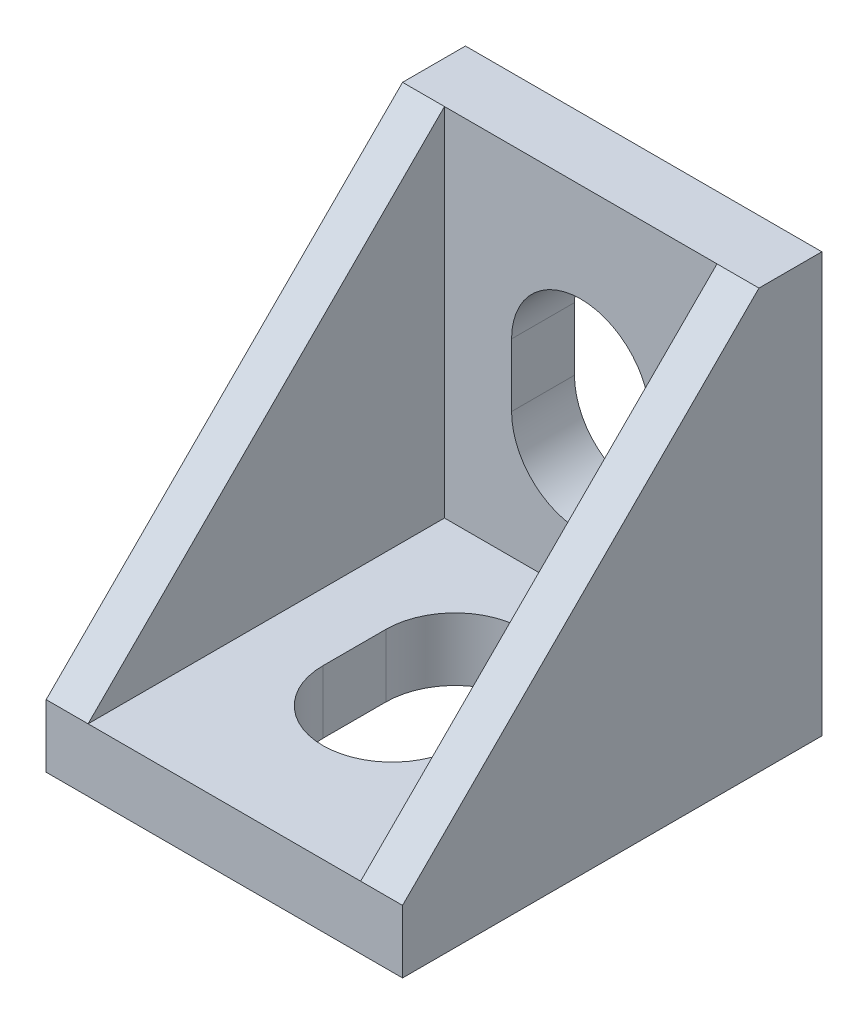
ISO-10303-21;
HEADER;
FILE_DESCRIPTION(('STEP AP214'),'2;1');
FILE_NAME('part.step','',(''),(''),'','','');
FILE_SCHEMA(('AUTOMOTIVE_DESIGN { 1 0 10303 214 1 1 1 1 }'));
ENDSEC;
DATA;
#1=APPLICATION_CONTEXT('core data for automotive mechanical design processes');
#2=APPLICATION_PROTOCOL_DEFINITION('international standard','automotive_design',2000,#1);
#3=PRODUCT_CONTEXT('',#1,'mechanical');
#4=PRODUCT('Part','Part','',(#3));
#5=PRODUCT_RELATED_PRODUCT_CATEGORY('part','',(#4));
#6=PRODUCT_DEFINITION_FORMATION('','',#4);
#7=PRODUCT_DEFINITION_CONTEXT('part definition',#1,'design');
#8=PRODUCT_DEFINITION('design','',#6,#7);
#9=PRODUCT_DEFINITION_SHAPE('','',#8);
#10=(LENGTH_UNIT() NAMED_UNIT(*) SI_UNIT(.MILLI.,.METRE.));
#11=(NAMED_UNIT(*) PLANE_ANGLE_UNIT() SI_UNIT($,.RADIAN.));
#12=(NAMED_UNIT(*) SI_UNIT($,.STERADIAN.) SOLID_ANGLE_UNIT());
#13=UNCERTAINTY_MEASURE_WITH_UNIT(LENGTH_MEASURE(1.E-05),#10,'distance_accuracy_value','');
#14=(GEOMETRIC_REPRESENTATION_CONTEXT(3) GLOBAL_UNCERTAINTY_ASSIGNED_CONTEXT((#13)) GLOBAL_UNIT_ASSIGNED_CONTEXT((#10,
#11,#12)) REPRESENTATION_CONTEXT('',''));
#15=CARTESIAN_POINT('',(0.,0.,0.));
#16=DIRECTION('',(0.,0.,1.));
#17=DIRECTION('',(1.,0.,0.));
#18=AXIS2_PLACEMENT_3D('',#15,#16,#17);
#19=CARTESIAN_POINT('',(8.5,0.,0.));
#20=DIRECTION('',(0.,1.,0.));
#21=DIRECTION('',(0.,0.,1.));
#22=AXIS2_PLACEMENT_3D('',#19,#20,#21);
#23=PLANE('',#22);
#24=DIRECTION('',(0.,0.,-1.));
#25=VECTOR('',#24,1.);
#26=CARTESIAN_POINT('',(-2.24999999999999,0.,18.6));
#27=LINE('',#26,#25);
#28=CARTESIAN_POINT('',(-2.24999999999999,0.,18.6));
#29=VERTEX_POINT('',#28);
#30=CARTESIAN_POINT('',(-2.24999999999999,0.,17.));
#31=VERTEX_POINT('',#30);
#32=EDGE_CURVE('E267',#29,#31,#27,.T.);
#33=ORIENTED_EDGE('',*,*,#32,.F.);
#34=DIRECTION('',(-1.,0.,0.));
#35=VECTOR('',#34,1.);
#36=CARTESIAN_POINT('',(-2.24999999999999,0.,18.6));
#37=LINE('',#36,#35);
#38=CARTESIAN_POINT('',(2.25000000000001,0.,18.6));
#39=VERTEX_POINT('',#38);
#40=EDGE_CURVE('E280',#39,#29,#37,.T.);
#41=ORIENTED_EDGE('',*,*,#40,.F.);
#42=DIRECTION('',(0.,0.,1.));
#43=VECTOR('',#42,1.);
#44=CARTESIAN_POINT('',(2.25000000000001,0.,18.6));
#45=LINE('',#44,#43);
#46=CARTESIAN_POINT('',(2.24999999999999,0.,17.));
#47=VERTEX_POINT('',#46);
#48=EDGE_CURVE('E289',#47,#39,#45,.T.);
#49=ORIENTED_EDGE('',*,*,#48,.F.);
#50=DIRECTION('',(1.,0.,0.));
#51=VECTOR('',#50,1.);
#52=CARTESIAN_POINT('',(-2.24999999999999,0.,17.));
#53=LINE('',#52,#51);
#54=EDGE_CURVE('E270',#31,#47,#53,.T.);
#55=ORIENTED_EDGE('',*,*,#54,.F.);
#56=EDGE_LOOP('',(#33,#41,#49,#55));
#57=FACE_BOUND('',#56,.T.);
#58=DIRECTION('',(0.,0.,-1.));
#59=VECTOR('',#58,1.);
#60=CARTESIAN_POINT('',(3.3,0.,9.));
#61=LINE('',#60,#59);
#62=CARTESIAN_POINT('',(3.3,0.,12.));
#63=VERTEX_POINT('',#62);
#64=CARTESIAN_POINT('',(3.3,0.,9.));
#65=VERTEX_POINT('',#64);
#66=EDGE_CURVE('E382',#63,#65,#61,.T.);
#67=ORIENTED_EDGE('',*,*,#66,.T.);
#68=CARTESIAN_POINT('',(0.,0.,9.));
#69=DIRECTION('',(0.,1.,0.));
#70=DIRECTION('',(0.,0.,1.));
#71=AXIS2_PLACEMENT_3D('',#68,#69,#70);
#72=CIRCLE('',#71,3.3);
#73=CARTESIAN_POINT('',(-3.3,0.,9.));
#74=VERTEX_POINT('',#73);
#75=EDGE_CURVE('E372',#65,#74,#72,.T.);
#76=ORIENTED_EDGE('',*,*,#75,.T.);
#77=DIRECTION('',(0.,0.,1.));
#78=VECTOR('',#77,1.);
#79=CARTESIAN_POINT('',(-3.3,0.,9.));
#80=LINE('',#79,#78);
#81=CARTESIAN_POINT('',(-3.3,0.,12.));
#82=VERTEX_POINT('',#81);
#83=EDGE_CURVE('E375',#74,#82,#80,.T.);
#84=ORIENTED_EDGE('',*,*,#83,.T.);
#85=CARTESIAN_POINT('',(0.,0.,12.));
#86=DIRECTION('',(0.,1.,0.));
#87=DIRECTION('',(0.,0.,1.));
#88=AXIS2_PLACEMENT_3D('',#85,#86,#87);
#89=CIRCLE('',#88,3.3);
#90=EDGE_CURVE('E379',#82,#63,#89,.T.);
#91=ORIENTED_EDGE('',*,*,#90,.T.);
#92=EDGE_LOOP('',(#67,#76,#84,#91));
#93=FACE_BOUND('',#92,.T.);
#94=DIRECTION('',(0.,0.,-1.));
#95=VECTOR('',#94,1.);
#96=CARTESIAN_POINT('',(-8.5,0.,0.));
#97=LINE('',#96,#95);
#98=CARTESIAN_POINT('',(-8.5,0.,20.));
#99=VERTEX_POINT('',#98);
#100=CARTESIAN_POINT('',(-8.5,0.,0.));
#101=VERTEX_POINT('',#100);
#102=EDGE_CURVE('E471',#99,#101,#97,.T.);
#103=ORIENTED_EDGE('',*,*,#102,.T.);
#104=DIRECTION('',(-1.,0.,0.));
#105=VECTOR('',#104,1.);
#106=CARTESIAN_POINT('',(8.5,0.,0.));
#107=LINE('',#106,#105);
#108=CARTESIAN_POINT('',(8.5,0.,0.));
#109=VERTEX_POINT('',#108);
#110=EDGE_CURVE('E478',#109,#101,#107,.T.);
#111=ORIENTED_EDGE('',*,*,#110,.F.);
#112=DIRECTION('',(0.,0.,-1.));
#113=VECTOR('',#112,1.);
#114=CARTESIAN_POINT('',(8.5,0.,0.));
#115=LINE('',#114,#113);
#116=CARTESIAN_POINT('',(8.5,0.,20.));
#117=VERTEX_POINT('',#116);
#118=EDGE_CURVE('E476',#117,#109,#115,.T.);
#119=ORIENTED_EDGE('',*,*,#118,.F.);
#120=DIRECTION('',(-1.,0.,0.));
#121=VECTOR('',#120,1.);
#122=CARTESIAN_POINT('',(8.5,0.,20.));
#123=LINE('',#122,#121);
#124=EDGE_CURVE('E489',#117,#99,#123,.T.);
#125=ORIENTED_EDGE('',*,*,#124,.T.);
#126=EDGE_LOOP('',(#103,#111,#119,#125));
#127=FACE_BOUND('',#126,.T.);
#128=DIRECTION('',(0.,0.,-1.));
#129=VECTOR('',#128,1.);
#130=CARTESIAN_POINT('',(-2.25,0.,3.));
#131=LINE('',#130,#129);
#132=CARTESIAN_POINT('',(-2.25,0.,3.));
#133=VERTEX_POINT('',#132);
#134=CARTESIAN_POINT('',(-2.25,0.,1.4));
#135=VERTEX_POINT('',#134);
#136=EDGE_CURVE('E266',#133,#135,#131,.T.);
#137=ORIENTED_EDGE('',*,*,#136,.F.);
#138=DIRECTION('',(-1.,0.,0.));
#139=VECTOR('',#138,1.);
#140=CARTESIAN_POINT('',(-2.25,0.,3.));
#141=LINE('',#140,#139);
#142=CARTESIAN_POINT('',(2.25,0.,3.));
#143=VERTEX_POINT('',#142);
#144=EDGE_CURVE('E263',#143,#133,#141,.T.);
#145=ORIENTED_EDGE('',*,*,#144,.F.);
#146=DIRECTION('',(0.,0.,1.));
#147=VECTOR('',#146,1.);
#148=CARTESIAN_POINT('',(2.25,0.,3.));
#149=LINE('',#148,#147);
#150=CARTESIAN_POINT('',(2.25,0.,1.4));
#151=VERTEX_POINT('',#150);
#152=EDGE_CURVE('E57',#151,#143,#149,.T.);
#153=ORIENTED_EDGE('',*,*,#152,.F.);
#154=DIRECTION('',(1.,0.,0.));
#155=VECTOR('',#154,1.);
#156=CARTESIAN_POINT('',(-2.25,0.,1.4));
#157=LINE('',#156,#155);
#158=EDGE_CURVE('E52',#135,#151,#157,.T.);
#159=ORIENTED_EDGE('',*,*,#158,.F.);
#160=EDGE_LOOP('',(#137,#145,#153,#159));
#161=FACE_BOUND('',#160,.T.);
#162=ADVANCED_FACE('F37',(#57,#93,#127,#161),#23,.F.);
#163=CARTESIAN_POINT('',(8.5,0.,0.));
#164=DIRECTION('',(0.,0.,1.));
#165=DIRECTION('',(1.,0.,0.));
#166=AXIS2_PLACEMENT_3D('',#163,#164,#165);
#167=PLANE('',#166);
#168=DIRECTION('',(0.,-1.,0.));
#169=VECTOR('',#168,1.);
#170=CARTESIAN_POINT('',(2.25000000000001,18.6,0.));
#171=LINE('',#170,#169);
#172=CARTESIAN_POINT('',(2.25000000000001,18.6,0.));
#173=VERTEX_POINT('',#172);
#174=CARTESIAN_POINT('',(2.25000000000001,17.,0.));
#175=VERTEX_POINT('',#174);
#176=EDGE_CURVE('E338',#173,#175,#171,.T.);
#177=ORIENTED_EDGE('',*,*,#176,.F.);
#178=DIRECTION('',(1.,0.,0.));
#179=VECTOR('',#178,1.);
#180=CARTESIAN_POINT('',(2.25000000000001,18.6,0.));
#181=LINE('',#180,#179);
#182=CARTESIAN_POINT('',(-2.24999999999999,18.6,0.));
#183=VERTEX_POINT('',#182);
#184=EDGE_CURVE('E343',#183,#173,#181,.T.);
#185=ORIENTED_EDGE('',*,*,#184,.F.);
#186=DIRECTION('',(0.,1.,0.));
#187=VECTOR('',#186,1.);
#188=CARTESIAN_POINT('',(-2.24999999999999,18.6,0.));
#189=LINE('',#188,#187);
#190=CARTESIAN_POINT('',(-2.25000000000001,17.,0.));
#191=VERTEX_POINT('',#190);
#192=EDGE_CURVE('E355',#191,#183,#189,.T.);
#193=ORIENTED_EDGE('',*,*,#192,.F.);
#194=DIRECTION('',(-1.,0.,0.));
#195=VECTOR('',#194,1.);
#196=CARTESIAN_POINT('',(2.25000000000001,17.,0.));
#197=LINE('',#196,#195);
#198=EDGE_CURVE('E352',#175,#191,#197,.T.);
#199=ORIENTED_EDGE('',*,*,#198,.F.);
#200=EDGE_LOOP('',(#177,#185,#193,#199));
#201=FACE_BOUND('',#200,.T.);
#202=DIRECTION('',(0.,-1.,0.));
#203=VECTOR('',#202,1.);
#204=CARTESIAN_POINT('',(-3.3,9.,0.));
#205=LINE('',#204,#203);
#206=CARTESIAN_POINT('',(-3.3,12.,0.));
#207=VERTEX_POINT('',#206);
#208=CARTESIAN_POINT('',(-3.3,9.,0.));
#209=VERTEX_POINT('',#208);
#210=EDGE_CURVE('E414',#207,#209,#205,.T.);
#211=ORIENTED_EDGE('',*,*,#210,.T.);
#212=CARTESIAN_POINT('',(0.,9.,0.));
#213=DIRECTION('',(0.,0.,1.));
#214=DIRECTION('',(1.,0.,0.));
#215=AXIS2_PLACEMENT_3D('',#212,#213,#214);
#216=CIRCLE('',#215,3.3);
#217=CARTESIAN_POINT('',(3.3,9.,0.));
#218=VERTEX_POINT('',#217);
#219=EDGE_CURVE('E404',#209,#218,#216,.T.);
#220=ORIENTED_EDGE('',*,*,#219,.T.);
#221=DIRECTION('',(0.,1.,0.));
#222=VECTOR('',#221,1.);
#223=CARTESIAN_POINT('',(3.3,9.,0.));
#224=LINE('',#223,#222);
#225=CARTESIAN_POINT('',(3.3,12.,0.));
#226=VERTEX_POINT('',#225);
#227=EDGE_CURVE('E407',#218,#226,#224,.T.);
#228=ORIENTED_EDGE('',*,*,#227,.T.);
#229=CARTESIAN_POINT('',(0.,12.,0.));
#230=DIRECTION('',(0.,0.,1.));
#231=DIRECTION('',(1.,0.,0.));
#232=AXIS2_PLACEMENT_3D('',#229,#230,#231);
#233=CIRCLE('',#232,3.3);
#234=EDGE_CURVE('E411',#226,#207,#233,.T.);
#235=ORIENTED_EDGE('',*,*,#234,.T.);
#236=EDGE_LOOP('',(#211,#220,#228,#235));
#237=FACE_BOUND('',#236,.T.);
#238=DIRECTION('',(0.,1.,0.));
#239=VECTOR('',#238,1.);
#240=CARTESIAN_POINT('',(-8.5,0.,0.));
#241=LINE('',#240,#239);
#242=CARTESIAN_POINT('',(-8.5,20.,0.));
#243=VERTEX_POINT('',#242);
#244=EDGE_CURVE('E462',#101,#243,#241,.T.);
#245=ORIENTED_EDGE('',*,*,#244,.T.);
#246=DIRECTION('',(-1.,0.,0.));
#247=VECTOR('',#246,1.);
#248=CARTESIAN_POINT('',(8.5,20.,0.));
#249=LINE('',#248,#247);
#250=CARTESIAN_POINT('',(8.5,20.,0.));
#251=VERTEX_POINT('',#250);
#252=EDGE_CURVE('E492',#251,#243,#249,.T.);
#253=ORIENTED_EDGE('',*,*,#252,.F.);
#254=DIRECTION('',(0.,1.,0.));
#255=VECTOR('',#254,1.);
#256=CARTESIAN_POINT('',(8.5,0.,0.));
#257=LINE('',#256,#255);
#258=EDGE_CURVE('E467',#109,#251,#257,.T.);
#259=ORIENTED_EDGE('',*,*,#258,.F.);
#260=ORIENTED_EDGE('',*,*,#110,.T.);
#261=EDGE_LOOP('',(#245,#253,#259,#260));
#262=FACE_BOUND('',#261,.T.);
#263=DIRECTION('',(0.,-1.,0.));
#264=VECTOR('',#263,1.);
#265=CARTESIAN_POINT('',(2.25000000000001,3.,0.));
#266=LINE('',#265,#264);
#267=CARTESIAN_POINT('',(2.25000000000001,3.,0.));
#268=VERTEX_POINT('',#267);
#269=CARTESIAN_POINT('',(2.25000000000001,1.4,0.));
#270=VERTEX_POINT('',#269);
#271=EDGE_CURVE('E305',#268,#270,#266,.T.);
#272=ORIENTED_EDGE('',*,*,#271,.F.);
#273=DIRECTION('',(1.,0.,0.));
#274=VECTOR('',#273,1.);
#275=CARTESIAN_POINT('',(2.25000000000001,3.,0.));
#276=LINE('',#275,#274);
#277=CARTESIAN_POINT('',(-2.25000000000001,3.,0.));
#278=VERTEX_POINT('',#277);
#279=EDGE_CURVE('E310',#278,#268,#276,.T.);
#280=ORIENTED_EDGE('',*,*,#279,.F.);
#281=DIRECTION('',(0.,1.,0.));
#282=VECTOR('',#281,1.);
#283=CARTESIAN_POINT('',(-2.25000000000001,3.,0.));
#284=LINE('',#283,#282);
#285=CARTESIAN_POINT('',(-2.25000000000001,1.4,0.));
#286=VERTEX_POINT('',#285);
#287=EDGE_CURVE('E322',#286,#278,#284,.T.);
#288=ORIENTED_EDGE('',*,*,#287,.F.);
#289=DIRECTION('',(-1.,0.,0.));
#290=VECTOR('',#289,1.);
#291=CARTESIAN_POINT('',(2.25000000000001,1.4,0.));
#292=LINE('',#291,#290);
#293=EDGE_CURVE('E319',#270,#286,#292,.T.);
#294=ORIENTED_EDGE('',*,*,#293,.F.);
#295=EDGE_LOOP('',(#272,#280,#288,#294));
#296=FACE_BOUND('',#295,.T.);
#297=ADVANCED_FACE('F39',(#201,#237,#262,#296),#167,.F.);
#298=CARTESIAN_POINT('',(8.5,20.,3.));
#299=DIRECTION('',(0.,-0.707106781186547,-0.707106781186548));
#300=DIRECTION('',(0.,0.707106781186548,-0.707106781186547));
#301=AXIS2_PLACEMENT_3D('',#298,#299,#300);
#302=PLANE('',#301);
#303=DIRECTION('',(-1.,0.,0.));
#304=VECTOR('',#303,1.);
#305=CARTESIAN_POINT('',(8.5,3.,20.));
#306=LINE('',#305,#304);
#307=CARTESIAN_POINT('',(-6.5,3.,20.));
#308=VERTEX_POINT('',#307);
#309=CARTESIAN_POINT('',(-8.5,3.,20.));
#310=VERTEX_POINT('',#309);
#311=EDGE_CURVE('E463',#308,#310,#306,.T.);
#312=ORIENTED_EDGE('',*,*,#311,.F.);
#313=DIRECTION('',(0.,0.707106781186548,-0.707106781186547));
#314=VECTOR('',#313,1.);
#315=CARTESIAN_POINT('',(-6.5,20.,3.));
#316=LINE('',#315,#314);
#317=CARTESIAN_POINT('',(-6.5,20.,3.00000000000001));
#318=VERTEX_POINT('',#317);
#319=EDGE_CURVE('E13',#308,#318,#316,.T.);
#320=ORIENTED_EDGE('',*,*,#319,.T.);
#321=DIRECTION('',(-1.,0.,0.));
#322=VECTOR('',#321,1.);
#323=CARTESIAN_POINT('',(8.5,20.,3.));
#324=LINE('',#323,#322);
#325=CARTESIAN_POINT('',(-8.5,20.,3.));
#326=VERTEX_POINT('',#325);
#327=EDGE_CURVE('E456',#318,#326,#324,.T.);
#328=ORIENTED_EDGE('',*,*,#327,.T.);
#329=DIRECTION('',(0.,-0.707106781186548,0.707106781186547));
#330=VECTOR('',#329,1.);
#331=CARTESIAN_POINT('',(-8.5,20.,3.));
#332=LINE('',#331,#330);
#333=EDGE_CURVE('E452',#326,#310,#332,.T.);
#334=ORIENTED_EDGE('',*,*,#333,.T.);
#335=EDGE_LOOP('',(#312,#320,#328,#334));
#336=FACE_BOUND('',#335,.T.);
#337=ADVANCED_FACE('F519',(#336),#302,.F.);
#338=CARTESIAN_POINT('',(8.5,20.,0.));
#339=DIRECTION('',(0.,-1.,0.));
#340=DIRECTION('',(0.,0.,-1.));
#341=AXIS2_PLACEMENT_3D('',#338,#339,#340);
#342=PLANE('',#341);
#343=DIRECTION('',(0.,0.,1.));
#344=VECTOR('',#343,1.);
#345=CARTESIAN_POINT('',(-8.5,20.,0.));
#346=LINE('',#345,#344);
#347=EDGE_CURVE('E481',#243,#326,#346,.T.);
#348=ORIENTED_EDGE('',*,*,#347,.T.);
#349=ORIENTED_EDGE('',*,*,#327,.F.);
#350=DIRECTION('',(-1.,0.,0.));
#351=VECTOR('',#350,1.);
#352=CARTESIAN_POINT('',(-6.5,20.,3.00000000000001));
#353=LINE('',#352,#351);
#354=CARTESIAN_POINT('',(6.5,20.,3.));
#355=VERTEX_POINT('',#354);
#356=EDGE_CURVE('E429',#355,#318,#353,.T.);
#357=ORIENTED_EDGE('',*,*,#356,.F.);
#358=CARTESIAN_POINT('',(8.5,20.,3.));
#359=VERTEX_POINT('',#358);
#360=EDGE_CURVE('E464',#359,#355,#324,.T.);
#361=ORIENTED_EDGE('',*,*,#360,.F.);
#362=DIRECTION('',(0.,0.,1.));
#363=VECTOR('',#362,1.);
#364=CARTESIAN_POINT('',(8.5,20.,0.));
#365=LINE('',#364,#363);
#366=EDGE_CURVE('E470',#251,#359,#365,.T.);
#367=ORIENTED_EDGE('',*,*,#366,.F.);
#368=ORIENTED_EDGE('',*,*,#252,.T.);
#369=EDGE_LOOP('',(#348,#349,#357,#361,#367,#368));
#370=FACE_BOUND('',#369,.T.);
#371=ADVANCED_FACE('F511',(#370),#342,.F.);
#372=CARTESIAN_POINT('',(8.5,0.,20.));
#373=DIRECTION('',(0.,0.,-1.));
#374=DIRECTION('',(-1.,0.,0.));
#375=AXIS2_PLACEMENT_3D('',#372,#373,#374);
#376=PLANE('',#375);
#377=DIRECTION('',(0.,-1.,0.));
#378=VECTOR('',#377,1.);
#379=CARTESIAN_POINT('',(8.5,0.,20.));
#380=LINE('',#379,#378);
#381=CARTESIAN_POINT('',(8.5,3.,20.));
#382=VERTEX_POINT('',#381);
#383=EDGE_CURVE('E474',#382,#117,#380,.T.);
#384=ORIENTED_EDGE('',*,*,#383,.F.);
#385=CARTESIAN_POINT('',(6.50000000000001,2.99999999999999,20.));
#386=VERTEX_POINT('',#385);
#387=EDGE_CURVE('E459',#382,#386,#306,.T.);
#388=ORIENTED_EDGE('',*,*,#387,.T.);
#389=DIRECTION('',(-1.,0.,0.));
#390=VECTOR('',#389,1.);
#391=CARTESIAN_POINT('',(-6.5,3.,20.));
#392=LINE('',#391,#390);
#393=EDGE_CURVE('E443',#386,#308,#392,.T.);
#394=ORIENTED_EDGE('',*,*,#393,.T.);
#395=ORIENTED_EDGE('',*,*,#311,.T.);
#396=DIRECTION('',(0.,-1.,0.));
#397=VECTOR('',#396,1.);
#398=CARTESIAN_POINT('',(-8.5,0.,20.));
#399=LINE('',#398,#397);
#400=EDGE_CURVE('E484',#310,#99,#399,.T.);
#401=ORIENTED_EDGE('',*,*,#400,.T.);
#402=ORIENTED_EDGE('',*,*,#124,.F.);
#403=EDGE_LOOP('',(#384,#388,#394,#395,#401,#402));
#404=FACE_BOUND('',#403,.T.);
#405=ADVANCED_FACE('F502',(#404),#376,.F.);
#406=CARTESIAN_POINT('',(8.5,0.,0.));
#407=DIRECTION('',(1.,0.,0.));
#408=DIRECTION('',(0.,0.,-1.));
#409=AXIS2_PLACEMENT_3D('',#406,#407,#408);
#410=PLANE('',#409);
#411=DIRECTION('',(0.,-0.707106781186548,0.707106781186547));
#412=VECTOR('',#411,1.);
#413=CARTESIAN_POINT('',(8.5,20.,3.));
#414=LINE('',#413,#412);
#415=EDGE_CURVE('E453',#359,#382,#414,.T.);
#416=ORIENTED_EDGE('',*,*,#415,.T.);
#417=ORIENTED_EDGE('',*,*,#383,.T.);
#418=ORIENTED_EDGE('',*,*,#118,.T.);
#419=ORIENTED_EDGE('',*,*,#258,.T.);
#420=ORIENTED_EDGE('',*,*,#366,.T.);
#421=EDGE_LOOP('',(#416,#417,#418,#419,#420));
#422=FACE_BOUND('',#421,.T.);
#423=ADVANCED_FACE('F507',(#422),#410,.T.);
#424=CARTESIAN_POINT('',(-8.5,0.,0.));
#425=DIRECTION('',(1.,0.,0.));
#426=DIRECTION('',(0.,0.,-1.));
#427=AXIS2_PLACEMENT_3D('',#424,#425,#426);
#428=PLANE('',#427);
#429=ORIENTED_EDGE('',*,*,#400,.F.);
#430=ORIENTED_EDGE('',*,*,#333,.F.);
#431=ORIENTED_EDGE('',*,*,#347,.F.);
#432=ORIENTED_EDGE('',*,*,#244,.F.);
#433=ORIENTED_EDGE('',*,*,#102,.F.);
#434=EDGE_LOOP('',(#429,#430,#431,#432,#433));
#435=FACE_BOUND('',#434,.T.);
#436=ADVANCED_FACE('F547',(#435),#428,.F.);
#437=ORIENTED_EDGE('',*,*,#360,.T.);
#438=DIRECTION('',(0.,-0.707106781186548,0.707106781186547));
#439=VECTOR('',#438,1.);
#440=CARTESIAN_POINT('',(6.5,20.,3.));
#441=LINE('',#440,#439);
#442=EDGE_CURVE('E45',#355,#386,#441,.T.);
#443=ORIENTED_EDGE('',*,*,#442,.T.);
#444=ORIENTED_EDGE('',*,*,#387,.F.);
#445=ORIENTED_EDGE('',*,*,#415,.F.);
#446=EDGE_LOOP('',(#437,#443,#444,#445));
#447=FACE_BOUND('',#446,.T.);
#448=ADVANCED_FACE('F496',(#447),#302,.F.);
#449=CARTESIAN_POINT('',(-6.5,-21.4009345590327,20.));
#450=DIRECTION('',(-1.,0.,0.));
#451=DIRECTION('',(0.,0.,1.));
#452=AXIS2_PLACEMENT_3D('',#449,#450,#451);
#453=PLANE('',#452);
#454=DIRECTION('',(0.,0.,-1.));
#455=VECTOR('',#454,1.);
#456=CARTESIAN_POINT('',(-6.5,3.,20.));
#457=LINE('',#456,#455);
#458=CARTESIAN_POINT('',(-6.5,3.,3.));
#459=VERTEX_POINT('',#458);
#460=EDGE_CURVE('E441',#308,#459,#457,.T.);
#461=ORIENTED_EDGE('',*,*,#460,.T.);
#462=DIRECTION('',(0.,1.,0.));
#463=VECTOR('',#462,1.);
#464=CARTESIAN_POINT('',(-6.5,-21.4009345590327,3.));
#465=LINE('',#464,#463);
#466=EDGE_CURVE('E439',#459,#318,#465,.T.);
#467=ORIENTED_EDGE('',*,*,#466,.T.);
#468=ORIENTED_EDGE('',*,*,#319,.F.);
#469=EDGE_LOOP('',(#461,#467,#468));
#470=FACE_BOUND('',#469,.T.);
#471=ADVANCED_FACE('F522',(#470),#453,.F.);
#472=CARTESIAN_POINT('',(6.50000000000001,-21.4009345590327,20.));
#473=DIRECTION('',(1.,0.,0.));
#474=DIRECTION('',(0.,0.,-1.));
#475=AXIS2_PLACEMENT_3D('',#472,#473,#474);
#476=PLANE('',#475);
#477=DIRECTION('',(0.,1.,0.));
#478=VECTOR('',#477,1.);
#479=CARTESIAN_POINT('',(6.5,-21.4009345590327,3.));
#480=LINE('',#479,#478);
#481=CARTESIAN_POINT('',(6.5,3.,3.));
#482=VERTEX_POINT('',#481);
#483=EDGE_CURVE('E446',#482,#355,#480,.T.);
#484=ORIENTED_EDGE('',*,*,#483,.F.);
#485=DIRECTION('',(0.,0.,1.));
#486=VECTOR('',#485,1.);
#487=CARTESIAN_POINT('',(6.50000000000001,3.,20.));
#488=LINE('',#487,#486);
#489=EDGE_CURVE('E436',#482,#386,#488,.T.);
#490=ORIENTED_EDGE('',*,*,#489,.T.);
#491=ORIENTED_EDGE('',*,*,#442,.F.);
#492=EDGE_LOOP('',(#484,#490,#491));
#493=FACE_BOUND('',#492,.T.);
#494=ADVANCED_FACE('F527',(#493),#476,.F.);
#495=CARTESIAN_POINT('',(-6.5,-21.4009345590327,3.));
#496=DIRECTION('',(0.,0.,-1.));
#497=DIRECTION('',(-1.,0.,0.));
#498=AXIS2_PLACEMENT_3D('',#495,#496,#497);
#499=PLANE('',#498);
#500=DIRECTION('',(0.,1.,0.));
#501=VECTOR('',#500,1.);
#502=CARTESIAN_POINT('',(3.3,9.,3.));
#503=LINE('',#502,#501);
#504=CARTESIAN_POINT('',(3.3,9.,3.));
#505=VERTEX_POINT('',#504);
#506=CARTESIAN_POINT('',(3.3,12.,3.));
#507=VERTEX_POINT('',#506);
#508=EDGE_CURVE('E419',#505,#507,#503,.T.);
#509=ORIENTED_EDGE('',*,*,#508,.F.);
#510=CARTESIAN_POINT('',(0.,9.,3.));
#511=DIRECTION('',(0.,0.,1.));
#512=DIRECTION('',(1.,0.,0.));
#513=AXIS2_PLACEMENT_3D('',#510,#511,#512);
#514=CIRCLE('',#513,3.3);
#515=CARTESIAN_POINT('',(-3.3,9.,3.));
#516=VERTEX_POINT('',#515);
#517=EDGE_CURVE('E397',#516,#505,#514,.T.);
#518=ORIENTED_EDGE('',*,*,#517,.F.);
#519=DIRECTION('',(0.,-1.,0.));
#520=VECTOR('',#519,1.);
#521=CARTESIAN_POINT('',(-3.3,9.,3.));
#522=LINE('',#521,#520);
#523=CARTESIAN_POINT('',(-3.3,12.,3.));
#524=VERTEX_POINT('',#523);
#525=EDGE_CURVE('E408',#524,#516,#522,.T.);
#526=ORIENTED_EDGE('',*,*,#525,.F.);
#527=CARTESIAN_POINT('',(0.,12.,3.));
#528=DIRECTION('',(0.,0.,1.));
#529=DIRECTION('',(1.,0.,0.));
#530=AXIS2_PLACEMENT_3D('',#527,#528,#529);
#531=CIRCLE('',#530,3.3);
#532=EDGE_CURVE('E422',#507,#524,#531,.T.);
#533=ORIENTED_EDGE('',*,*,#532,.F.);
#534=EDGE_LOOP('',(#509,#518,#526,#533));
#535=FACE_BOUND('',#534,.T.);
#536=DIRECTION('',(1.,0.,0.));
#537=VECTOR('',#536,1.);
#538=CARTESIAN_POINT('',(-6.5,3.,3.));
#539=LINE('',#538,#537);
#540=EDGE_CURVE('E438',#459,#482,#539,.T.);
#541=ORIENTED_EDGE('',*,*,#540,.T.);
#542=ORIENTED_EDGE('',*,*,#483,.T.);
#543=ORIENTED_EDGE('',*,*,#356,.T.);
#544=ORIENTED_EDGE('',*,*,#466,.F.);
#545=EDGE_LOOP('',(#541,#542,#543,#544));
#546=FACE_BOUND('',#545,.T.);
#547=ADVANCED_FACE('F515',(#535,#546),#499,.F.);
#548=CARTESIAN_POINT('',(8.5,3.,0.));
#549=DIRECTION('',(0.,1.,0.));
#550=DIRECTION('',(0.,0.,1.));
#551=AXIS2_PLACEMENT_3D('',#548,#549,#550);
#552=PLANE('',#551);
#553=CARTESIAN_POINT('',(0.,3.,9.));
#554=DIRECTION('',(0.,1.,0.));
#555=DIRECTION('',(0.,0.,1.));
#556=AXIS2_PLACEMENT_3D('',#553,#554,#555);
#557=CIRCLE('',#556,3.3);
#558=CARTESIAN_POINT('',(3.3,3.,9.));
#559=VERTEX_POINT('',#558);
#560=CARTESIAN_POINT('',(-3.3,3.,9.));
#561=VERTEX_POINT('',#560);
#562=EDGE_CURVE('E371',#559,#561,#557,.T.);
#563=ORIENTED_EDGE('',*,*,#562,.F.);
#564=DIRECTION('',(0.,0.,-1.));
#565=VECTOR('',#564,1.);
#566=CARTESIAN_POINT('',(3.3,3.,9.));
#567=LINE('',#566,#565);
#568=CARTESIAN_POINT('',(3.3,3.,12.));
#569=VERTEX_POINT('',#568);
#570=EDGE_CURVE('E376',#569,#559,#567,.T.);
#571=ORIENTED_EDGE('',*,*,#570,.F.);
#572=CARTESIAN_POINT('',(0.,3.,12.));
#573=DIRECTION('',(0.,1.,0.));
#574=DIRECTION('',(0.,0.,1.));
#575=AXIS2_PLACEMENT_3D('',#572,#573,#574);
#576=CIRCLE('',#575,3.3);
#577=CARTESIAN_POINT('',(-3.3,3.,12.));
#578=VERTEX_POINT('',#577);
#579=EDGE_CURVE('E390',#578,#569,#576,.T.);
#580=ORIENTED_EDGE('',*,*,#579,.F.);
#581=DIRECTION('',(0.,0.,1.));
#582=VECTOR('',#581,1.);
#583=CARTESIAN_POINT('',(-3.3,3.,9.));
#584=LINE('',#583,#582);
#585=EDGE_CURVE('E387',#561,#578,#584,.T.);
#586=ORIENTED_EDGE('',*,*,#585,.F.);
#587=EDGE_LOOP('',(#563,#571,#580,#586));
#588=FACE_BOUND('',#587,.T.);
#589=ORIENTED_EDGE('',*,*,#460,.F.);
#590=ORIENTED_EDGE('',*,*,#393,.F.);
#591=ORIENTED_EDGE('',*,*,#489,.F.);
#592=ORIENTED_EDGE('',*,*,#540,.F.);
#593=EDGE_LOOP('',(#589,#590,#591,#592));
#594=FACE_BOUND('',#593,.T.);
#595=ADVANCED_FACE('F526',(#588,#594),#552,.T.);
#596=CARTESIAN_POINT('',(0.,9.,0.));
#597=DIRECTION('',(0.,0.,1.));
#598=DIRECTION('',(1.,0.,0.));
#599=AXIS2_PLACEMENT_3D('',#596,#597,#598);
#600=CYLINDRICAL_SURFACE('',#599,3.3);
#601=ORIENTED_EDGE('',*,*,#517,.T.);
#602=DIRECTION('',(0.,0.,1.));
#603=VECTOR('',#602,1.);
#604=CARTESIAN_POINT('',(3.3,9.,0.));
#605=LINE('',#604,#603);
#606=EDGE_CURVE('E417',#218,#505,#605,.T.);
#607=ORIENTED_EDGE('',*,*,#606,.F.);
#608=ORIENTED_EDGE('',*,*,#219,.F.);
#609=DIRECTION('',(0.,0.,1.));
#610=VECTOR('',#609,1.);
#611=CARTESIAN_POINT('',(-3.3,9.,0.));
#612=LINE('',#611,#610);
#613=EDGE_CURVE('E427',#209,#516,#612,.T.);
#614=ORIENTED_EDGE('',*,*,#613,.T.);
#615=EDGE_LOOP('',(#601,#607,#608,#614));
#616=FACE_BOUND('',#615,.T.);
#617=ADVANCED_FACE('F641',(#616),#600,.F.);
#618=CARTESIAN_POINT('',(-3.3,9.,0.));
#619=DIRECTION('',(-1.,0.,0.));
#620=DIRECTION('',(0.,0.,1.));
#621=AXIS2_PLACEMENT_3D('',#618,#619,#620);
#622=PLANE('',#621);
#623=ORIENTED_EDGE('',*,*,#525,.T.);
#624=ORIENTED_EDGE('',*,*,#613,.F.);
#625=ORIENTED_EDGE('',*,*,#210,.F.);
#626=DIRECTION('',(0.,0.,1.));
#627=VECTOR('',#626,1.);
#628=CARTESIAN_POINT('',(-3.3,12.,0.));
#629=LINE('',#628,#627);
#630=EDGE_CURVE('E430',#207,#524,#629,.T.);
#631=ORIENTED_EDGE('',*,*,#630,.T.);
#632=EDGE_LOOP('',(#623,#624,#625,#631));
#633=FACE_BOUND('',#632,.T.);
#634=ADVANCED_FACE('F637',(#633),#622,.F.);
#635=CARTESIAN_POINT('',(0.,12.,0.));
#636=DIRECTION('',(0.,0.,1.));
#637=DIRECTION('',(1.,0.,0.));
#638=AXIS2_PLACEMENT_3D('',#635,#636,#637);
#639=CYLINDRICAL_SURFACE('',#638,3.3);
#640=ORIENTED_EDGE('',*,*,#532,.T.);
#641=ORIENTED_EDGE('',*,*,#630,.F.);
#642=ORIENTED_EDGE('',*,*,#234,.F.);
#643=DIRECTION('',(0.,0.,1.));
#644=VECTOR('',#643,1.);
#645=CARTESIAN_POINT('',(3.3,12.,0.));
#646=LINE('',#645,#644);
#647=EDGE_CURVE('E432',#226,#507,#646,.T.);
#648=ORIENTED_EDGE('',*,*,#647,.T.);
#649=EDGE_LOOP('',(#640,#641,#642,#648));
#650=FACE_BOUND('',#649,.T.);
#651=ADVANCED_FACE('F640',(#650),#639,.F.);
#652=CARTESIAN_POINT('',(3.3,9.,0.));
#653=DIRECTION('',(1.,0.,0.));
#654=DIRECTION('',(0.,0.,-1.));
#655=AXIS2_PLACEMENT_3D('',#652,#653,#654);
#656=PLANE('',#655);
#657=ORIENTED_EDGE('',*,*,#508,.T.);
#658=ORIENTED_EDGE('',*,*,#647,.F.);
#659=ORIENTED_EDGE('',*,*,#227,.F.);
#660=ORIENTED_EDGE('',*,*,#606,.T.);
#661=EDGE_LOOP('',(#657,#658,#659,#660));
#662=FACE_BOUND('',#661,.T.);
#663=ADVANCED_FACE('F635',(#662),#656,.F.);
#664=CARTESIAN_POINT('',(0.,0.,9.));
#665=DIRECTION('',(0.,1.,0.));
#666=DIRECTION('',(0.,0.,1.));
#667=AXIS2_PLACEMENT_3D('',#664,#665,#666);
#668=CYLINDRICAL_SURFACE('',#667,3.3);
#669=ORIENTED_EDGE('',*,*,#562,.T.);
#670=DIRECTION('',(0.,1.,0.));
#671=VECTOR('',#670,1.);
#672=CARTESIAN_POINT('',(-3.3,0.,9.));
#673=LINE('',#672,#671);
#674=EDGE_CURVE('E385',#74,#561,#673,.T.);
#675=ORIENTED_EDGE('',*,*,#674,.F.);
#676=ORIENTED_EDGE('',*,*,#75,.F.);
#677=DIRECTION('',(0.,1.,0.));
#678=VECTOR('',#677,1.);
#679=CARTESIAN_POINT('',(3.3,0.,9.));
#680=LINE('',#679,#678);
#681=EDGE_CURVE('E395',#65,#559,#680,.T.);
#682=ORIENTED_EDGE('',*,*,#681,.T.);
#683=EDGE_LOOP('',(#669,#675,#676,#682));
#684=FACE_BOUND('',#683,.T.);
#685=ADVANCED_FACE('F625',(#684),#668,.F.);
#686=CARTESIAN_POINT('',(3.3,0.,9.));
#687=DIRECTION('',(1.,0.,0.));
#688=DIRECTION('',(0.,0.,-1.));
#689=AXIS2_PLACEMENT_3D('',#686,#687,#688);
#690=PLANE('',#689);
#691=ORIENTED_EDGE('',*,*,#570,.T.);
#692=ORIENTED_EDGE('',*,*,#681,.F.);
#693=ORIENTED_EDGE('',*,*,#66,.F.);
#694=DIRECTION('',(0.,1.,0.));
#695=VECTOR('',#694,1.);
#696=CARTESIAN_POINT('',(3.3,0.,12.));
#697=LINE('',#696,#695);
#698=EDGE_CURVE('E398',#63,#569,#697,.T.);
#699=ORIENTED_EDGE('',*,*,#698,.T.);
#700=EDGE_LOOP('',(#691,#692,#693,#699));
#701=FACE_BOUND('',#700,.T.);
#702=ADVANCED_FACE('F621',(#701),#690,.F.);
#703=CARTESIAN_POINT('',(0.,0.,12.));
#704=DIRECTION('',(0.,1.,0.));
#705=DIRECTION('',(0.,0.,1.));
#706=AXIS2_PLACEMENT_3D('',#703,#704,#705);
#707=CYLINDRICAL_SURFACE('',#706,3.3);
#708=ORIENTED_EDGE('',*,*,#579,.T.);
#709=ORIENTED_EDGE('',*,*,#698,.F.);
#710=ORIENTED_EDGE('',*,*,#90,.F.);
#711=DIRECTION('',(0.,1.,0.));
#712=VECTOR('',#711,1.);
#713=CARTESIAN_POINT('',(-3.3,0.,12.));
#714=LINE('',#713,#712);
#715=EDGE_CURVE('E400',#82,#578,#714,.T.);
#716=ORIENTED_EDGE('',*,*,#715,.T.);
#717=EDGE_LOOP('',(#708,#709,#710,#716));
#718=FACE_BOUND('',#717,.T.);
#719=ADVANCED_FACE('F624',(#718),#707,.F.);
#720=CARTESIAN_POINT('',(-3.3,0.,9.));
#721=DIRECTION('',(-1.,0.,0.));
#722=DIRECTION('',(0.,0.,1.));
#723=AXIS2_PLACEMENT_3D('',#720,#721,#722);
#724=PLANE('',#723);
#725=ORIENTED_EDGE('',*,*,#585,.T.);
#726=ORIENTED_EDGE('',*,*,#715,.F.);
#727=ORIENTED_EDGE('',*,*,#83,.F.);
#728=ORIENTED_EDGE('',*,*,#674,.T.);
#729=EDGE_LOOP('',(#725,#726,#727,#728));
#730=FACE_BOUND('',#729,.T.);
#731=ADVANCED_FACE('F619',(#730),#724,.F.);
#732=CARTESIAN_POINT('',(2.25000000000001,18.6,-1.));
#733=DIRECTION('',(-1.,0.,0.));
#734=DIRECTION('',(0.,0.,1.));
#735=AXIS2_PLACEMENT_3D('',#732,#733,#734);
#736=PLANE('',#735);
#737=ORIENTED_EDGE('',*,*,#176,.T.);
#738=DIRECTION('',(0.,0.,1.));
#739=VECTOR('',#738,1.);
#740=CARTESIAN_POINT('',(2.25000000000001,17.,-1.));
#741=LINE('',#740,#739);
#742=CARTESIAN_POINT('',(2.25000000000001,17.,-1.));
#743=VERTEX_POINT('',#742);
#744=EDGE_CURVE('E368',#743,#175,#741,.T.);
#745=ORIENTED_EDGE('',*,*,#744,.F.);
#746=DIRECTION('',(0.,-1.,0.));
#747=VECTOR('',#746,1.);
#748=CARTESIAN_POINT('',(2.25000000000001,18.6,-1.));
#749=LINE('',#748,#747);
#750=CARTESIAN_POINT('',(2.25000000000001,18.6,-1.));
#751=VERTEX_POINT('',#750);
#752=EDGE_CURVE('E339',#751,#743,#749,.T.);
#753=ORIENTED_EDGE('',*,*,#752,.F.);
#754=DIRECTION('',(0.,0.,1.));
#755=VECTOR('',#754,1.);
#756=CARTESIAN_POINT('',(2.25000000000001,18.6,-1.));
#757=LINE('',#756,#755);
#758=EDGE_CURVE('E349',#751,#173,#757,.T.);
#759=ORIENTED_EDGE('',*,*,#758,.T.);
#760=EDGE_LOOP('',(#737,#745,#753,#759));
#761=FACE_BOUND('',#760,.T.);
#762=ADVANCED_FACE('F615',(#761),#736,.F.);
#763=CARTESIAN_POINT('',(2.25000000000001,17.,-1.));
#764=DIRECTION('',(0.,1.,0.));
#765=DIRECTION('',(0.,0.,1.));
#766=AXIS2_PLACEMENT_3D('',#763,#764,#765);
#767=PLANE('',#766);
#768=ORIENTED_EDGE('',*,*,#198,.T.);
#769=DIRECTION('',(0.,0.,1.));
#770=VECTOR('',#769,1.);
#771=CARTESIAN_POINT('',(-2.25000000000001,17.,-1.));
#772=LINE('',#771,#770);
#773=CARTESIAN_POINT('',(-2.25000000000001,17.,-1.));
#774=VERTEX_POINT('',#773);
#775=EDGE_CURVE('E365',#774,#191,#772,.T.);
#776=ORIENTED_EDGE('',*,*,#775,.F.);
#777=DIRECTION('',(-1.,0.,0.));
#778=VECTOR('',#777,1.);
#779=CARTESIAN_POINT('',(2.25000000000001,17.,-1.));
#780=LINE('',#779,#778);
#781=EDGE_CURVE('E342',#743,#774,#780,.T.);
#782=ORIENTED_EDGE('',*,*,#781,.F.);
#783=ORIENTED_EDGE('',*,*,#744,.T.);
#784=EDGE_LOOP('',(#768,#776,#782,#783));
#785=FACE_BOUND('',#784,.T.);
#786=ADVANCED_FACE('F611',(#785),#767,.F.);
#787=CARTESIAN_POINT('',(-2.24999999999999,18.6,-1.));
#788=DIRECTION('',(1.,0.,0.));
#789=DIRECTION('',(0.,1.,0.));
#790=AXIS2_PLACEMENT_3D('',#787,#788,#789);
#791=PLANE('',#790);
#792=ORIENTED_EDGE('',*,*,#192,.T.);
#793=DIRECTION('',(0.,0.,1.));
#794=VECTOR('',#793,1.);
#795=CARTESIAN_POINT('',(-2.24999999999999,18.6,-1.));
#796=LINE('',#795,#794);
#797=CARTESIAN_POINT('',(-2.24999999999999,18.6,-1.));
#798=VERTEX_POINT('',#797);
#799=EDGE_CURVE('E362',#798,#183,#796,.T.);
#800=ORIENTED_EDGE('',*,*,#799,.F.);
#801=DIRECTION('',(0.,1.,0.));
#802=VECTOR('',#801,1.);
#803=CARTESIAN_POINT('',(-2.24999999999999,18.6,-1.));
#804=LINE('',#803,#802);
#805=EDGE_CURVE('E345',#774,#798,#804,.T.);
#806=ORIENTED_EDGE('',*,*,#805,.F.);
#807=ORIENTED_EDGE('',*,*,#775,.T.);
#808=EDGE_LOOP('',(#792,#800,#806,#807));
#809=FACE_BOUND('',#808,.T.);
#810=ADVANCED_FACE('F607',(#809),#791,.F.);
#811=CARTESIAN_POINT('',(2.25000000000001,18.6,-1.));
#812=DIRECTION('',(0.,-1.,0.));
#813=DIRECTION('',(0.,0.,-1.));
#814=AXIS2_PLACEMENT_3D('',#811,#812,#813);
#815=PLANE('',#814);
#816=ORIENTED_EDGE('',*,*,#184,.T.);
#817=ORIENTED_EDGE('',*,*,#758,.F.);
#818=DIRECTION('',(1.,0.,0.));
#819=VECTOR('',#818,1.);
#820=CARTESIAN_POINT('',(2.25000000000001,18.6,-1.));
#821=LINE('',#820,#819);
#822=EDGE_CURVE('E347',#798,#751,#821,.T.);
#823=ORIENTED_EDGE('',*,*,#822,.F.);
#824=ORIENTED_EDGE('',*,*,#799,.T.);
#825=EDGE_LOOP('',(#816,#817,#823,#824));
#826=FACE_BOUND('',#825,.T.);
#827=ADVANCED_FACE('F603',(#826),#815,.F.);
#828=CARTESIAN_POINT('',(0.,0.,-1.));
#829=DIRECTION('',(0.,0.,-1.));
#830=DIRECTION('',(-1.,0.,0.));
#831=AXIS2_PLACEMENT_3D('',#828,#829,#830);
#832=PLANE('',#831);
#833=ORIENTED_EDGE('',*,*,#752,.T.);
#834=ORIENTED_EDGE('',*,*,#781,.T.);
#835=ORIENTED_EDGE('',*,*,#805,.T.);
#836=ORIENTED_EDGE('',*,*,#822,.T.);
#837=EDGE_LOOP('',(#833,#834,#835,#836));
#838=FACE_BOUND('',#837,.T.);
#839=ADVANCED_FACE('F597',(#838),#832,.T.);
#840=CARTESIAN_POINT('',(2.25000000000001,3.,-1.));
#841=DIRECTION('',(-1.,0.,0.));
#842=DIRECTION('',(0.,-1.,0.));
#843=AXIS2_PLACEMENT_3D('',#840,#841,#842);
#844=PLANE('',#843);
#845=ORIENTED_EDGE('',*,*,#271,.T.);
#846=DIRECTION('',(0.,0.,1.));
#847=VECTOR('',#846,1.);
#848=CARTESIAN_POINT('',(2.25000000000001,1.4,-1.));
#849=LINE('',#848,#847);
#850=CARTESIAN_POINT('',(2.25000000000001,1.4,-1.));
#851=VERTEX_POINT('',#850);
#852=EDGE_CURVE('E335',#851,#270,#849,.T.);
#853=ORIENTED_EDGE('',*,*,#852,.F.);
#854=DIRECTION('',(0.,-1.,0.));
#855=VECTOR('',#854,1.);
#856=CARTESIAN_POINT('',(2.25000000000001,3.,-1.));
#857=LINE('',#856,#855);
#858=CARTESIAN_POINT('',(2.25000000000001,3.,-1.));
#859=VERTEX_POINT('',#858);
#860=EDGE_CURVE('E306',#859,#851,#857,.T.);
#861=ORIENTED_EDGE('',*,*,#860,.F.);
#862=DIRECTION('',(0.,0.,1.));
#863=VECTOR('',#862,1.);
#864=CARTESIAN_POINT('',(2.25000000000001,3.,-1.));
#865=LINE('',#864,#863);
#866=EDGE_CURVE('E316',#859,#268,#865,.T.);
#867=ORIENTED_EDGE('',*,*,#866,.T.);
#868=EDGE_LOOP('',(#845,#853,#861,#867));
#869=FACE_BOUND('',#868,.T.);
#870=ADVANCED_FACE('F581',(#869),#844,.F.);
#871=CARTESIAN_POINT('',(2.25000000000001,1.4,-1.));
#872=DIRECTION('',(0.,1.,0.));
#873=DIRECTION('',(-1.,0.,0.));
#874=AXIS2_PLACEMENT_3D('',#871,#872,#873);
#875=PLANE('',#874);
#876=ORIENTED_EDGE('',*,*,#293,.T.);
#877=DIRECTION('',(0.,0.,1.));
#878=VECTOR('',#877,1.);
#879=CARTESIAN_POINT('',(-2.25000000000001,1.4,-1.));
#880=LINE('',#879,#878);
#881=CARTESIAN_POINT('',(-2.25000000000001,1.4,-1.));
#882=VERTEX_POINT('',#881);
#883=EDGE_CURVE('E332',#882,#286,#880,.T.);
#884=ORIENTED_EDGE('',*,*,#883,.F.);
#885=DIRECTION('',(-1.,0.,0.));
#886=VECTOR('',#885,1.);
#887=CARTESIAN_POINT('',(2.25000000000001,1.4,-1.));
#888=LINE('',#887,#886);
#889=EDGE_CURVE('E309',#851,#882,#888,.T.);
#890=ORIENTED_EDGE('',*,*,#889,.F.);
#891=ORIENTED_EDGE('',*,*,#852,.T.);
#892=EDGE_LOOP('',(#876,#884,#890,#891));
#893=FACE_BOUND('',#892,.T.);
#894=ADVANCED_FACE('F589',(#893),#875,.F.);
#895=CARTESIAN_POINT('',(-2.25000000000001,3.,-1.));
#896=DIRECTION('',(1.,0.,0.));
#897=DIRECTION('',(0.,1.,0.));
#898=AXIS2_PLACEMENT_3D('',#895,#896,#897);
#899=PLANE('',#898);
#900=ORIENTED_EDGE('',*,*,#287,.T.);
#901=DIRECTION('',(0.,0.,1.));
#902=VECTOR('',#901,1.);
#903=CARTESIAN_POINT('',(-2.25000000000001,3.,-1.));
#904=LINE('',#903,#902);
#905=CARTESIAN_POINT('',(-2.25000000000001,3.,-1.));
#906=VERTEX_POINT('',#905);
#907=EDGE_CURVE('E329',#906,#278,#904,.T.);
#908=ORIENTED_EDGE('',*,*,#907,.F.);
#909=DIRECTION('',(0.,1.,0.));
#910=VECTOR('',#909,1.);
#911=CARTESIAN_POINT('',(-2.25000000000001,3.,-1.));
#912=LINE('',#911,#910);
#913=EDGE_CURVE('E312',#882,#906,#912,.T.);
#914=ORIENTED_EDGE('',*,*,#913,.F.);
#915=ORIENTED_EDGE('',*,*,#883,.T.);
#916=EDGE_LOOP('',(#900,#908,#914,#915));
#917=FACE_BOUND('',#916,.T.);
#918=ADVANCED_FACE('F587',(#917),#899,.F.);
#919=CARTESIAN_POINT('',(2.25000000000001,3.,-1.));
#920=DIRECTION('',(0.,-1.,0.));
#921=DIRECTION('',(1.,0.,0.));
#922=AXIS2_PLACEMENT_3D('',#919,#920,#921);
#923=PLANE('',#922);
#924=ORIENTED_EDGE('',*,*,#279,.T.);
#925=ORIENTED_EDGE('',*,*,#866,.F.);
#926=DIRECTION('',(1.,0.,0.));
#927=VECTOR('',#926,1.);
#928=CARTESIAN_POINT('',(2.25000000000001,3.,-1.));
#929=LINE('',#928,#927);
#930=EDGE_CURVE('E314',#906,#859,#929,.T.);
#931=ORIENTED_EDGE('',*,*,#930,.F.);
#932=ORIENTED_EDGE('',*,*,#907,.T.);
#933=EDGE_LOOP('',(#924,#925,#931,#932));
#934=FACE_BOUND('',#933,.T.);
#935=ADVANCED_FACE('F577',(#934),#923,.F.);
#936=CARTESIAN_POINT('',(0.,0.,-1.));
#937=DIRECTION('',(0.,0.,-1.));
#938=DIRECTION('',(-1.,0.,0.));
#939=AXIS2_PLACEMENT_3D('',#936,#937,#938);
#940=PLANE('',#939);
#941=ORIENTED_EDGE('',*,*,#860,.T.);
#942=ORIENTED_EDGE('',*,*,#889,.T.);
#943=ORIENTED_EDGE('',*,*,#913,.T.);
#944=ORIENTED_EDGE('',*,*,#930,.T.);
#945=EDGE_LOOP('',(#941,#942,#943,#944));
#946=FACE_BOUND('',#945,.T.);
#947=ADVANCED_FACE('F583',(#946),#940,.T.);
#948=CARTESIAN_POINT('',(-2.24999999999999,-1.,18.6));
#949=DIRECTION('',(1.,0.,0.));
#950=DIRECTION('',(0.,0.,-1.));
#951=AXIS2_PLACEMENT_3D('',#948,#949,#950);
#952=PLANE('',#951);
#953=ORIENTED_EDGE('',*,*,#32,.T.);
#954=DIRECTION('',(0.,1.,0.));
#955=VECTOR('',#954,1.);
#956=CARTESIAN_POINT('',(-2.24999999999999,-1.,17.));
#957=LINE('',#956,#955);
#958=CARTESIAN_POINT('',(-2.24999999999999,-1.,17.));
#959=VERTEX_POINT('',#958);
#960=EDGE_CURVE('E302',#959,#31,#957,.T.);
#961=ORIENTED_EDGE('',*,*,#960,.F.);
#962=DIRECTION('',(0.,0.,-1.));
#963=VECTOR('',#962,1.);
#964=CARTESIAN_POINT('',(-2.24999999999999,-1.,18.6));
#965=LINE('',#964,#963);
#966=CARTESIAN_POINT('',(-2.24999999999999,-1.,18.6));
#967=VERTEX_POINT('',#966);
#968=EDGE_CURVE('E276',#967,#959,#965,.T.);
#969=ORIENTED_EDGE('',*,*,#968,.F.);
#970=DIRECTION('',(0.,1.,0.));
#971=VECTOR('',#970,1.);
#972=CARTESIAN_POINT('',(-2.24999999999999,-1.,18.6));
#973=LINE('',#972,#971);
#974=EDGE_CURVE('E285',#967,#29,#973,.T.);
#975=ORIENTED_EDGE('',*,*,#974,.T.);
#976=EDGE_LOOP('',(#953,#961,#969,#975));
#977=FACE_BOUND('',#976,.T.);
#978=ADVANCED_FACE('F748',(#977),#952,.F.);
#979=CARTESIAN_POINT('',(-2.24999999999999,-1.,17.));
#980=DIRECTION('',(0.,0.,1.));
#981=DIRECTION('',(0.,-1.,0.));
#982=AXIS2_PLACEMENT_3D('',#979,#980,#981);
#983=PLANE('',#982);
#984=ORIENTED_EDGE('',*,*,#54,.T.);
#985=DIRECTION('',(0.,1.,0.));
#986=VECTOR('',#985,1.);
#987=CARTESIAN_POINT('',(2.24999999999999,-1.,17.));
#988=LINE('',#987,#986);
#989=CARTESIAN_POINT('',(2.24999999999999,-1.,17.));
#990=VERTEX_POINT('',#989);
#991=EDGE_CURVE('E299',#990,#47,#988,.T.);
#992=ORIENTED_EDGE('',*,*,#991,.F.);
#993=DIRECTION('',(1.,0.,0.));
#994=VECTOR('',#993,1.);
#995=CARTESIAN_POINT('',(-2.24999999999999,-1.,17.));
#996=LINE('',#995,#994);
#997=EDGE_CURVE('E279',#959,#990,#996,.T.);
#998=ORIENTED_EDGE('',*,*,#997,.F.);
#999=ORIENTED_EDGE('',*,*,#960,.T.);
#1000=EDGE_LOOP('',(#984,#992,#998,#999));
#1001=FACE_BOUND('',#1000,.T.);
#1002=ADVANCED_FACE('F762',(#1001),#983,.F.);
#1003=CARTESIAN_POINT('',(2.25000000000001,-1.,18.6));
#1004=DIRECTION('',(-1.,0.,0.));
#1005=DIRECTION('',(0.,0.,1.));
#1006=AXIS2_PLACEMENT_3D('',#1003,#1004,#1005);
#1007=PLANE('',#1006);
#1008=ORIENTED_EDGE('',*,*,#48,.T.);
#1009=DIRECTION('',(0.,1.,0.));
#1010=VECTOR('',#1009,1.);
#1011=CARTESIAN_POINT('',(2.25000000000001,-1.,18.6));
#1012=LINE('',#1011,#1010);
#1013=CARTESIAN_POINT('',(2.25000000000001,-1.,18.6));
#1014=VERTEX_POINT('',#1013);
#1015=EDGE_CURVE('E296',#1014,#39,#1012,.T.);
#1016=ORIENTED_EDGE('',*,*,#1015,.F.);
#1017=DIRECTION('',(0.,0.,1.));
#1018=VECTOR('',#1017,1.);
#1019=CARTESIAN_POINT('',(2.25000000000001,-1.,18.6));
#1020=LINE('',#1019,#1018);
#1021=EDGE_CURVE('E282',#990,#1014,#1020,.T.);
#1022=ORIENTED_EDGE('',*,*,#1021,.F.);
#1023=ORIENTED_EDGE('',*,*,#991,.T.);
#1024=EDGE_LOOP('',(#1008,#1016,#1022,#1023));
#1025=FACE_BOUND('',#1024,.T.);
#1026=ADVANCED_FACE('F772',(#1025),#1007,.F.);
#1027=CARTESIAN_POINT('',(-2.24999999999999,-1.,18.6));
#1028=DIRECTION('',(0.,0.,-1.));
#1029=DIRECTION('',(0.,1.,0.));
#1030=AXIS2_PLACEMENT_3D('',#1027,#1028,#1029);
#1031=PLANE('',#1030);
#1032=ORIENTED_EDGE('',*,*,#40,.T.);
#1033=ORIENTED_EDGE('',*,*,#974,.F.);
#1034=DIRECTION('',(-1.,0.,0.));
#1035=VECTOR('',#1034,1.);
#1036=CARTESIAN_POINT('',(-2.24999999999999,-1.,18.6));
#1037=LINE('',#1036,#1035);
#1038=EDGE_CURVE('E284',#1014,#967,#1037,.T.);
#1039=ORIENTED_EDGE('',*,*,#1038,.F.);
#1040=ORIENTED_EDGE('',*,*,#1015,.T.);
#1041=EDGE_LOOP('',(#1032,#1033,#1039,#1040));
#1042=FACE_BOUND('',#1041,.T.);
#1043=ADVANCED_FACE('F782',(#1042),#1031,.F.);
#1044=CARTESIAN_POINT('',(0.,-1.,0.));
#1045=DIRECTION('',(0.,-1.,0.));
#1046=DIRECTION('',(0.,0.,-1.));
#1047=AXIS2_PLACEMENT_3D('',#1044,#1045,#1046);
#1048=PLANE('',#1047);
#1049=ORIENTED_EDGE('',*,*,#968,.T.);
#1050=ORIENTED_EDGE('',*,*,#997,.T.);
#1051=ORIENTED_EDGE('',*,*,#1021,.T.);
#1052=ORIENTED_EDGE('',*,*,#1038,.T.);
#1053=EDGE_LOOP('',(#1049,#1050,#1051,#1052));
#1054=FACE_BOUND('',#1053,.T.);
#1055=ADVANCED_FACE('F792',(#1054),#1048,.T.);
#1056=CARTESIAN_POINT('',(-2.25,-1.,3.));
#1057=DIRECTION('',(1.,0.,0.));
#1058=DIRECTION('',(0.,0.,-1.));
#1059=AXIS2_PLACEMENT_3D('',#1056,#1057,#1058);
#1060=PLANE('',#1059);
#1061=ORIENTED_EDGE('',*,*,#136,.T.);
#1062=DIRECTION('',(0.,1.,0.));
#1063=VECTOR('',#1062,1.);
#1064=CARTESIAN_POINT('',(-2.25,-1.,1.4));
#1065=LINE('',#1064,#1063);
#1066=CARTESIAN_POINT('',(-2.25,-1.,1.4));
#1067=VERTEX_POINT('',#1066);
#1068=EDGE_CURVE('E247',#1067,#135,#1065,.T.);
#1069=ORIENTED_EDGE('',*,*,#1068,.F.);
#1070=DIRECTION('',(0.,0.,-1.));
#1071=VECTOR('',#1070,1.);
#1072=CARTESIAN_POINT('',(-2.25,-1.,3.));
#1073=LINE('',#1072,#1071);
#1074=CARTESIAN_POINT('',(-2.25,-1.,3.));
#1075=VERTEX_POINT('',#1074);
#1076=EDGE_CURVE('E254',#1075,#1067,#1073,.T.);
#1077=ORIENTED_EDGE('',*,*,#1076,.F.);
#1078=DIRECTION('',(0.,1.,0.));
#1079=VECTOR('',#1078,1.);
#1080=CARTESIAN_POINT('',(-2.25,-1.,3.));
#1081=LINE('',#1080,#1079);
#1082=EDGE_CURVE('E852',#1075,#133,#1081,.T.);
#1083=ORIENTED_EDGE('',*,*,#1082,.T.);
#1084=EDGE_LOOP('',(#1061,#1069,#1077,#1083));
#1085=FACE_BOUND('',#1084,.T.);
#1086=ADVANCED_FACE('F265',(#1085),#1060,.F.);
#1087=CARTESIAN_POINT('',(-2.25,-1.,1.4));
#1088=DIRECTION('',(0.,0.,1.));
#1089=DIRECTION('',(0.,-1.,0.));
#1090=AXIS2_PLACEMENT_3D('',#1087,#1088,#1089);
#1091=PLANE('',#1090);
#1092=ORIENTED_EDGE('',*,*,#158,.T.);
#1093=DIRECTION('',(0.,1.,0.));
#1094=VECTOR('',#1093,1.);
#1095=CARTESIAN_POINT('',(2.25,-1.,1.4));
#1096=LINE('',#1095,#1094);
#1097=CARTESIAN_POINT('',(2.25,-1.,1.4));
#1098=VERTEX_POINT('',#1097);
#1099=EDGE_CURVE('E250',#1098,#151,#1096,.T.);
#1100=ORIENTED_EDGE('',*,*,#1099,.F.);
#1101=DIRECTION('',(1.,0.,0.));
#1102=VECTOR('',#1101,1.);
#1103=CARTESIAN_POINT('',(-2.25,-1.,1.4));
#1104=LINE('',#1103,#1102);
#1105=EDGE_CURVE('E243',#1067,#1098,#1104,.T.);
#1106=ORIENTED_EDGE('',*,*,#1105,.F.);
#1107=ORIENTED_EDGE('',*,*,#1068,.T.);
#1108=EDGE_LOOP('',(#1092,#1100,#1106,#1107));
#1109=FACE_BOUND('',#1108,.T.);
#1110=ADVANCED_FACE('F245',(#1109),#1091,.F.);
#1111=CARTESIAN_POINT('',(2.25,-1.,3.));
#1112=DIRECTION('',(-1.,0.,0.));
#1113=DIRECTION('',(0.,0.,1.));
#1114=AXIS2_PLACEMENT_3D('',#1111,#1112,#1113);
#1115=PLANE('',#1114);
#1116=ORIENTED_EDGE('',*,*,#152,.T.);
#1117=DIRECTION('',(0.,1.,0.));
#1118=VECTOR('',#1117,1.);
#1119=CARTESIAN_POINT('',(2.25,-1.,3.));
#1120=LINE('',#1119,#1118);
#1121=CARTESIAN_POINT('',(2.25,-1.,3.));
#1122=VERTEX_POINT('',#1121);
#1123=EDGE_CURVE('E272',#1122,#143,#1120,.T.);
#1124=ORIENTED_EDGE('',*,*,#1123,.F.);
#1125=DIRECTION('',(0.,0.,1.));
#1126=VECTOR('',#1125,1.);
#1127=CARTESIAN_POINT('',(2.25,-1.,3.));
#1128=LINE('',#1127,#1126);
#1129=EDGE_CURVE('E253',#1098,#1122,#1128,.T.);
#1130=ORIENTED_EDGE('',*,*,#1129,.F.);
#1131=ORIENTED_EDGE('',*,*,#1099,.T.);
#1132=EDGE_LOOP('',(#1116,#1124,#1130,#1131));
#1133=FACE_BOUND('',#1132,.T.);
#1134=ADVANCED_FACE('F819',(#1133),#1115,.F.);
#1135=CARTESIAN_POINT('',(-2.25,-1.,3.));
#1136=DIRECTION('',(0.,0.,-1.));
#1137=DIRECTION('',(0.,1.,0.));
#1138=AXIS2_PLACEMENT_3D('',#1135,#1136,#1137);
#1139=PLANE('',#1138);
#1140=ORIENTED_EDGE('',*,*,#144,.T.);
#1141=ORIENTED_EDGE('',*,*,#1082,.F.);
#1142=DIRECTION('',(-1.,0.,0.));
#1143=VECTOR('',#1142,1.);
#1144=CARTESIAN_POINT('',(-2.25,-1.,3.));
#1145=LINE('',#1144,#1143);
#1146=EDGE_CURVE('E259',#1122,#1075,#1145,.T.);
#1147=ORIENTED_EDGE('',*,*,#1146,.F.);
#1148=ORIENTED_EDGE('',*,*,#1123,.T.);
#1149=EDGE_LOOP('',(#1140,#1141,#1147,#1148));
#1150=FACE_BOUND('',#1149,.T.);
#1151=ADVANCED_FACE('F828',(#1150),#1139,.F.);
#1152=CARTESIAN_POINT('',(0.,-1.,0.));
#1153=DIRECTION('',(0.,-1.,0.));
#1154=DIRECTION('',(0.,0.,-1.));
#1155=AXIS2_PLACEMENT_3D('',#1152,#1153,#1154);
#1156=PLANE('',#1155);
#1157=ORIENTED_EDGE('',*,*,#1076,.T.);
#1158=ORIENTED_EDGE('',*,*,#1105,.T.);
#1159=ORIENTED_EDGE('',*,*,#1129,.T.);
#1160=ORIENTED_EDGE('',*,*,#1146,.T.);
#1161=EDGE_LOOP('',(#1157,#1158,#1159,#1160));
#1162=FACE_BOUND('',#1161,.T.);
#1163=ADVANCED_FACE('F257',(#1162),#1156,.T.);
#1164=CLOSED_SHELL('',(#162,#297,#337,#371,#405,#423,#436,#448,#471,#494,#547,#595,#617,#634,
#651,#663,#685,#702,#719,#731,#762,#786,#810,#827,#839,#870,#894,#918,#935,#947,#978,#1002,
#1026,#1043,#1055,#1086,#1110,#1134,#1151,#1163));
#1165=MANIFOLD_SOLID_BREP('B2',#1164);
#1166=ADVANCED_BREP_SHAPE_REPRESENTATION('',(#18,#1165),#14);
#1167=SHAPE_DEFINITION_REPRESENTATION(#9,#1166);
ENDSEC;
END-ISO-10303-21;
